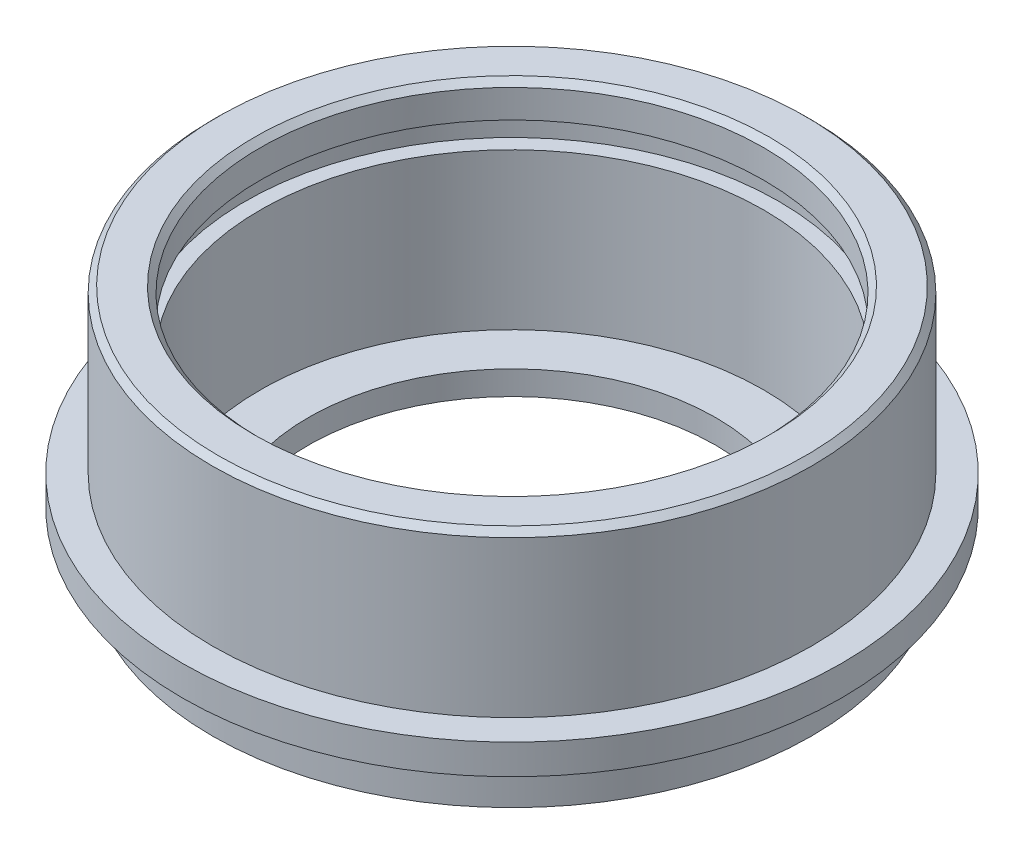
ISO-10303-21;
HEADER;
FILE_DESCRIPTION(('STEP AP214'),'2;1');
FILE_NAME('part.step','',(''),(''),'','','');
FILE_SCHEMA(('AUTOMOTIVE_DESIGN { 1 0 10303 214 1 1 1 1 }'));
ENDSEC;
DATA;
#1=APPLICATION_CONTEXT('core data for automotive mechanical design processes');
#2=APPLICATION_PROTOCOL_DEFINITION('international standard','automotive_design',2000,#1);
#3=PRODUCT_CONTEXT('',#1,'mechanical');
#4=PRODUCT('Part','Part','',(#3));
#5=PRODUCT_RELATED_PRODUCT_CATEGORY('part','',(#4));
#6=PRODUCT_DEFINITION_FORMATION('','',#4);
#7=PRODUCT_DEFINITION_CONTEXT('part definition',#1,'design');
#8=PRODUCT_DEFINITION('design','',#6,#7);
#9=PRODUCT_DEFINITION_SHAPE('','',#8);
#10=(LENGTH_UNIT() NAMED_UNIT(*) SI_UNIT(.MILLI.,.METRE.));
#11=(NAMED_UNIT(*) PLANE_ANGLE_UNIT() SI_UNIT($,.RADIAN.));
#12=(NAMED_UNIT(*) SI_UNIT($,.STERADIAN.) SOLID_ANGLE_UNIT());
#13=UNCERTAINTY_MEASURE_WITH_UNIT(LENGTH_MEASURE(1.E-05),#10,'distance_accuracy_value','');
#14=(GEOMETRIC_REPRESENTATION_CONTEXT(3) GLOBAL_UNCERTAINTY_ASSIGNED_CONTEXT((#13)) GLOBAL_UNIT_ASSIGNED_CONTEXT((#10,
#11,#12)) REPRESENTATION_CONTEXT('',''));
#15=CARTESIAN_POINT('',(0.,0.,0.));
#16=DIRECTION('',(0.,0.,1.));
#17=DIRECTION('',(1.,0.,0.));
#18=AXIS2_PLACEMENT_3D('',#15,#16,#17);
#19=CARTESIAN_POINT('',(25.,0.,0.));
#20=DIRECTION('',(0.,-1.,0.));
#21=DIRECTION('',(0.,0.,-1.));
#22=AXIS2_PLACEMENT_3D('',#19,#20,#21);
#23=PLANE('',#22);
#24=CARTESIAN_POINT('',(0.,0.,0.));
#25=DIRECTION('',(0.,-1.,0.));
#26=DIRECTION('',(0.,0.,-1.));
#27=AXIS2_PLACEMENT_3D('',#24,#25,#26);
#28=CIRCLE('',#27,25.);
#29=CARTESIAN_POINT('',(0.,0.,-25.));
#30=VERTEX_POINT('',#29);
#31=EDGE_CURVE('E89',#30,#30,#28,.T.);
#32=ORIENTED_EDGE('',*,*,#31,.T.);
#33=EDGE_LOOP('',(#32));
#34=FACE_BOUND('',#33,.T.);
#35=CARTESIAN_POINT('',(0.,0.,0.));
#36=DIRECTION('',(0.,-1.,0.));
#37=DIRECTION('',(0.,0.,-1.));
#38=AXIS2_PLACEMENT_3D('',#35,#36,#37);
#39=CIRCLE('',#38,17.);
#40=CARTESIAN_POINT('',(0.,0.,-17.));
#41=VERTEX_POINT('',#40);
#42=EDGE_CURVE('E56',#41,#41,#39,.T.);
#43=ORIENTED_EDGE('',*,*,#42,.F.);
#44=EDGE_LOOP('',(#43));
#45=FACE_BOUND('',#44,.T.);
#46=ADVANCED_FACE('F36',(#34,#45),#23,.T.);
#47=CARTESIAN_POINT('',(0.,0.,0.));
#48=DIRECTION('',(0.,-1.,0.));
#49=DIRECTION('',(0.,0.,-1.));
#50=AXIS2_PLACEMENT_3D('',#47,#48,#49);
#51=CYLINDRICAL_SURFACE('',#50,17.);
#52=ORIENTED_EDGE('',*,*,#42,.T.);
#53=EDGE_LOOP('',(#52));
#54=FACE_BOUND('',#53,.T.);
#55=CARTESIAN_POINT('',(0.,1.99999999999999,0.));
#56=DIRECTION('',(0.,-1.,0.));
#57=DIRECTION('',(0.,0.,-1.));
#58=AXIS2_PLACEMENT_3D('',#55,#56,#57);
#59=CIRCLE('',#58,17.);
#60=CARTESIAN_POINT('',(0.,1.99999999999999,-17.));
#61=VERTEX_POINT('',#60);
#62=EDGE_CURVE('E59',#61,#61,#59,.T.);
#63=ORIENTED_EDGE('',*,*,#62,.F.);
#64=EDGE_LOOP('',(#63));
#65=FACE_BOUND('',#64,.T.);
#66=ADVANCED_FACE('F110',(#54,#65),#51,.F.);
#67=CARTESIAN_POINT('',(17.,1.99999999999999,0.));
#68=DIRECTION('',(0.,1.,0.));
#69=DIRECTION('',(0.,0.,1.));
#70=AXIS2_PLACEMENT_3D('',#67,#68,#69);
#71=PLANE('',#70);
#72=ORIENTED_EDGE('',*,*,#62,.T.);
#73=EDGE_LOOP('',(#72));
#74=FACE_BOUND('',#73,.T.);
#75=CARTESIAN_POINT('',(0.,1.99999999999999,0.));
#76=DIRECTION('',(0.,-1.,0.));
#77=DIRECTION('',(0.,0.,-1.));
#78=AXIS2_PLACEMENT_3D('',#75,#76,#77);
#79=CIRCLE('',#78,21.);
#80=CARTESIAN_POINT('',(0.,1.99999999999999,-21.));
#81=VERTEX_POINT('',#80);
#82=EDGE_CURVE('E62',#81,#81,#79,.T.);
#83=ORIENTED_EDGE('',*,*,#82,.F.);
#84=EDGE_LOOP('',(#83));
#85=FACE_BOUND('',#84,.T.);
#86=ADVANCED_FACE('F115',(#74,#85),#71,.T.);
#87=CARTESIAN_POINT('',(0.,0.,0.));
#88=DIRECTION('',(0.,-1.,0.));
#89=DIRECTION('',(0.,0.,-1.));
#90=AXIS2_PLACEMENT_3D('',#87,#88,#89);
#91=CYLINDRICAL_SURFACE('',#90,21.);
#92=ORIENTED_EDGE('',*,*,#82,.T.);
#93=EDGE_LOOP('',(#92));
#94=FACE_BOUND('',#93,.T.);
#95=CARTESIAN_POINT('',(0.,15.,0.));
#96=DIRECTION('',(0.,-1.,0.));
#97=DIRECTION('',(0.,0.,-1.));
#98=AXIS2_PLACEMENT_3D('',#95,#96,#97);
#99=CIRCLE('',#98,21.);
#100=CARTESIAN_POINT('',(0.,15.,-21.));
#101=VERTEX_POINT('',#100);
#102=EDGE_CURVE('E65',#101,#101,#99,.T.);
#103=ORIENTED_EDGE('',*,*,#102,.F.);
#104=EDGE_LOOP('',(#103));
#105=FACE_BOUND('',#104,.T.);
#106=ADVANCED_FACE('F121',(#94,#105),#91,.F.);
#107=CARTESIAN_POINT('',(21.,15.,0.));
#108=DIRECTION('',(0.,1.,0.));
#109=DIRECTION('',(0.,0.,1.));
#110=AXIS2_PLACEMENT_3D('',#107,#108,#109);
#111=PLANE('',#110);
#112=ORIENTED_EDGE('',*,*,#102,.T.);
#113=EDGE_LOOP('',(#112));
#114=FACE_BOUND('',#113,.T.);
#115=CARTESIAN_POINT('',(0.,15.,0.));
#116=DIRECTION('',(0.,-1.,0.));
#117=DIRECTION('',(0.,0.,-1.));
#118=AXIS2_PLACEMENT_3D('',#115,#116,#117);
#119=CIRCLE('',#118,22.25);
#120=CARTESIAN_POINT('',(0.,15.,-22.25));
#121=VERTEX_POINT('',#120);
#122=EDGE_CURVE('E68',#121,#121,#119,.T.);
#123=ORIENTED_EDGE('',*,*,#122,.F.);
#124=EDGE_LOOP('',(#123));
#125=FACE_BOUND('',#124,.T.);
#126=ADVANCED_FACE('F125',(#114,#125),#111,.T.);
#127=CARTESIAN_POINT('',(0.,0.,0.));
#128=DIRECTION('',(0.,-1.,0.));
#129=DIRECTION('',(0.,0.,-1.));
#130=AXIS2_PLACEMENT_3D('',#127,#128,#129);
#131=CYLINDRICAL_SURFACE('',#130,22.25);
#132=ORIENTED_EDGE('',*,*,#122,.T.);
#133=EDGE_LOOP('',(#132));
#134=FACE_BOUND('',#133,.T.);
#135=CARTESIAN_POINT('',(0.,17.15,0.));
#136=DIRECTION('',(0.,-1.,0.));
#137=DIRECTION('',(0.,0.,-1.));
#138=AXIS2_PLACEMENT_3D('',#135,#136,#137);
#139=CIRCLE('',#138,22.25);
#140=CARTESIAN_POINT('',(0.,17.15,-22.25));
#141=VERTEX_POINT('',#140);
#142=EDGE_CURVE('E71',#141,#141,#139,.T.);
#143=ORIENTED_EDGE('',*,*,#142,.F.);
#144=EDGE_LOOP('',(#143));
#145=FACE_BOUND('',#144,.T.);
#146=ADVANCED_FACE('F129',(#134,#145),#131,.F.);
#147=CARTESIAN_POINT('',(22.25,17.15,0.));
#148=DIRECTION('',(0.,-1.,0.));
#149=DIRECTION('',(0.,0.,-1.));
#150=AXIS2_PLACEMENT_3D('',#147,#148,#149);
#151=PLANE('',#150);
#152=ORIENTED_EDGE('',*,*,#142,.T.);
#153=EDGE_LOOP('',(#152));
#154=FACE_BOUND('',#153,.T.);
#155=CARTESIAN_POINT('',(0.,17.15,0.));
#156=DIRECTION('',(0.,-1.,0.));
#157=DIRECTION('',(0.,0.,-1.));
#158=AXIS2_PLACEMENT_3D('',#155,#156,#157);
#159=CIRCLE('',#158,21.);
#160=CARTESIAN_POINT('',(0.,17.15,-21.));
#161=VERTEX_POINT('',#160);
#162=EDGE_CURVE('E74',#161,#161,#159,.T.);
#163=ORIENTED_EDGE('',*,*,#162,.F.);
#164=EDGE_LOOP('',(#163));
#165=FACE_BOUND('',#164,.T.);
#166=ADVANCED_FACE('F133',(#154,#165),#151,.T.);
#167=CARTESIAN_POINT('',(0.,0.,0.));
#168=DIRECTION('',(0.,-1.,0.));
#169=DIRECTION('',(0.,0.,-1.));
#170=AXIS2_PLACEMENT_3D('',#167,#168,#169);
#171=CYLINDRICAL_SURFACE('',#170,21.);
#172=CARTESIAN_POINT('',(0.,19.5,0.));
#173=DIRECTION('',(0.,1.,0.));
#174=DIRECTION('',(0.,0.,1.));
#175=AXIS2_PLACEMENT_3D('',#172,#173,#174);
#176=CIRCLE('',#175,21.);
#177=CARTESIAN_POINT('',(0.,19.5,21.));
#178=VERTEX_POINT('',#177);
#179=EDGE_CURVE('E10',#178,#178,#176,.T.);
#180=ORIENTED_EDGE('',*,*,#179,.T.);
#181=EDGE_LOOP('',(#180));
#182=FACE_BOUND('',#181,.T.);
#183=ORIENTED_EDGE('',*,*,#162,.T.);
#184=EDGE_LOOP('',(#183));
#185=FACE_BOUND('',#184,.T.);
#186=ADVANCED_FACE('F137',(#182,#185),#171,.F.);
#187=CARTESIAN_POINT('',(21.,20.,0.));
#188=DIRECTION('',(0.,1.,0.));
#189=DIRECTION('',(0.,0.,1.));
#190=AXIS2_PLACEMENT_3D('',#187,#188,#189);
#191=PLANE('',#190);
#192=CARTESIAN_POINT('',(0.,20.,0.));
#193=DIRECTION('',(0.,1.,0.));
#194=DIRECTION('',(0.,0.,1.));
#195=AXIS2_PLACEMENT_3D('',#192,#193,#194);
#196=CIRCLE('',#195,24.5);
#197=CARTESIAN_POINT('',(0.,20.,24.5));
#198=VERTEX_POINT('',#197);
#199=EDGE_CURVE('E43',#198,#198,#196,.T.);
#200=ORIENTED_EDGE('',*,*,#199,.T.);
#201=EDGE_LOOP('',(#200));
#202=FACE_BOUND('',#201,.T.);
#203=CARTESIAN_POINT('',(0.,20.,0.));
#204=DIRECTION('',(0.,1.,0.));
#205=DIRECTION('',(0.,0.,1.));
#206=AXIS2_PLACEMENT_3D('',#203,#204,#205);
#207=CIRCLE('',#206,21.5);
#208=CARTESIAN_POINT('',(0.,20.,21.5));
#209=VERTEX_POINT('',#208);
#210=EDGE_CURVE('E47',#209,#209,#207,.F.);
#211=ORIENTED_EDGE('',*,*,#210,.T.);
#212=EDGE_LOOP('',(#211));
#213=FACE_BOUND('',#212,.T.);
#214=ADVANCED_FACE('F141',(#202,#213),#191,.T.);
#215=CARTESIAN_POINT('',(0.,0.,0.));
#216=DIRECTION('',(0.,-1.,0.));
#217=DIRECTION('',(0.,0.,-1.));
#218=AXIS2_PLACEMENT_3D('',#215,#216,#217);
#219=CYLINDRICAL_SURFACE('',#218,25.);
#220=CARTESIAN_POINT('',(0.,19.5,0.));
#221=DIRECTION('',(0.,1.,0.));
#222=DIRECTION('',(0.,0.,1.));
#223=AXIS2_PLACEMENT_3D('',#220,#221,#222);
#224=CIRCLE('',#223,25.);
#225=CARTESIAN_POINT('',(0.,19.5,25.));
#226=VERTEX_POINT('',#225);
#227=EDGE_CURVE('E51',#226,#226,#224,.F.);
#228=ORIENTED_EDGE('',*,*,#227,.T.);
#229=EDGE_LOOP('',(#228));
#230=FACE_BOUND('',#229,.T.);
#231=CARTESIAN_POINT('',(0.,6.50000000000001,0.));
#232=DIRECTION('',(0.,-1.,0.));
#233=DIRECTION('',(0.,0.,-1.));
#234=AXIS2_PLACEMENT_3D('',#231,#232,#233);
#235=CIRCLE('',#234,25.);
#236=CARTESIAN_POINT('',(0.,6.50000000000001,-25.));
#237=VERTEX_POINT('',#236);
#238=EDGE_CURVE('E77',#237,#237,#235,.T.);
#239=ORIENTED_EDGE('',*,*,#238,.F.);
#240=EDGE_LOOP('',(#239));
#241=FACE_BOUND('',#240,.T.);
#242=ADVANCED_FACE('F144',(#230,#241),#219,.T.);
#243=CARTESIAN_POINT('',(25.,6.50000000000001,0.));
#244=DIRECTION('',(0.,1.,0.));
#245=DIRECTION('',(0.,0.,1.));
#246=AXIS2_PLACEMENT_3D('',#243,#244,#245);
#247=PLANE('',#246);
#248=ORIENTED_EDGE('',*,*,#238,.T.);
#249=EDGE_LOOP('',(#248));
#250=FACE_BOUND('',#249,.T.);
#251=CARTESIAN_POINT('',(0.,6.50000000000001,0.));
#252=DIRECTION('',(0.,-1.,0.));
#253=DIRECTION('',(0.,0.,-1.));
#254=AXIS2_PLACEMENT_3D('',#251,#252,#253);
#255=CIRCLE('',#254,27.5);
#256=CARTESIAN_POINT('',(0.,6.50000000000001,-27.5));
#257=VERTEX_POINT('',#256);
#258=EDGE_CURVE('E80',#257,#257,#255,.T.);
#259=ORIENTED_EDGE('',*,*,#258,.F.);
#260=EDGE_LOOP('',(#259));
#261=FACE_BOUND('',#260,.T.);
#262=ADVANCED_FACE('F147',(#250,#261),#247,.T.);
#263=CARTESIAN_POINT('',(0.,0.,0.));
#264=DIRECTION('',(0.,-1.,0.));
#265=DIRECTION('',(0.,0.,-1.));
#266=AXIS2_PLACEMENT_3D('',#263,#264,#265);
#267=CYLINDRICAL_SURFACE('',#266,27.5);
#268=ORIENTED_EDGE('',*,*,#258,.T.);
#269=EDGE_LOOP('',(#268));
#270=FACE_BOUND('',#269,.T.);
#271=CARTESIAN_POINT('',(0.,4.00000000000001,0.));
#272=DIRECTION('',(0.,-1.,0.));
#273=DIRECTION('',(0.,0.,-1.));
#274=AXIS2_PLACEMENT_3D('',#271,#272,#273);
#275=CIRCLE('',#274,27.5);
#276=CARTESIAN_POINT('',(0.,4.00000000000001,-27.5));
#277=VERTEX_POINT('',#276);
#278=EDGE_CURVE('E83',#277,#277,#275,.T.);
#279=ORIENTED_EDGE('',*,*,#278,.F.);
#280=EDGE_LOOP('',(#279));
#281=FACE_BOUND('',#280,.T.);
#282=ADVANCED_FACE('F106',(#270,#281),#267,.T.);
#283=CARTESIAN_POINT('',(27.5,4.00000000000001,0.));
#284=DIRECTION('',(0.,-1.,0.));
#285=DIRECTION('',(0.,0.,-1.));
#286=AXIS2_PLACEMENT_3D('',#283,#284,#285);
#287=PLANE('',#286);
#288=ORIENTED_EDGE('',*,*,#278,.T.);
#289=EDGE_LOOP('',(#288));
#290=FACE_BOUND('',#289,.T.);
#291=CARTESIAN_POINT('',(0.,4.00000000000001,0.));
#292=DIRECTION('',(0.,-1.,0.));
#293=DIRECTION('',(0.,0.,-1.));
#294=AXIS2_PLACEMENT_3D('',#291,#292,#293);
#295=CIRCLE('',#294,25.);
#296=CARTESIAN_POINT('',(0.,4.00000000000001,-25.));
#297=VERTEX_POINT('',#296);
#298=EDGE_CURVE('E86',#297,#297,#295,.T.);
#299=ORIENTED_EDGE('',*,*,#298,.F.);
#300=EDGE_LOOP('',(#299));
#301=FACE_BOUND('',#300,.T.);
#302=ADVANCED_FACE('F98',(#290,#301),#287,.T.);
#303=CARTESIAN_POINT('',(0.,0.,0.));
#304=DIRECTION('',(0.,-1.,0.));
#305=DIRECTION('',(0.,0.,-1.));
#306=AXIS2_PLACEMENT_3D('',#303,#304,#305);
#307=CYLINDRICAL_SURFACE('',#306,25.);
#308=ORIENTED_EDGE('',*,*,#298,.T.);
#309=EDGE_LOOP('',(#308));
#310=FACE_BOUND('',#309,.T.);
#311=ORIENTED_EDGE('',*,*,#31,.F.);
#312=EDGE_LOOP('',(#311));
#313=FACE_BOUND('',#312,.T.);
#314=ADVANCED_FACE('F95',(#310,#313),#307,.T.);
#315=CARTESIAN_POINT('',(0.,19.5,0.));
#316=DIRECTION('',(0.,-1.,0.));
#317=DIRECTION('',(0.,0.,-1.));
#318=AXIS2_PLACEMENT_3D('',#315,#316,#317);
#319=CONICAL_SURFACE('',#318,25.,0.785398163397448);
#320=ORIENTED_EDGE('',*,*,#199,.F.);
#321=EDGE_LOOP('',(#320));
#322=FACE_BOUND('',#321,.T.);
#323=ORIENTED_EDGE('',*,*,#227,.F.);
#324=EDGE_LOOP('',(#323));
#325=FACE_BOUND('',#324,.T.);
#326=ADVANCED_FACE('F97',(#322,#325),#319,.T.);
#327=CARTESIAN_POINT('',(0.,20.,0.));
#328=DIRECTION('',(0.,1.,0.));
#329=DIRECTION('',(0.,0.,1.));
#330=AXIS2_PLACEMENT_3D('',#327,#328,#329);
#331=CONICAL_SURFACE('',#330,21.5,0.785398163397445);
#332=ORIENTED_EDGE('',*,*,#179,.F.);
#333=EDGE_LOOP('',(#332));
#334=FACE_BOUND('',#333,.T.);
#335=ORIENTED_EDGE('',*,*,#210,.F.);
#336=EDGE_LOOP('',(#335));
#337=FACE_BOUND('',#336,.T.);
#338=ADVANCED_FACE('F38',(#334,#337),#331,.F.);
#339=CLOSED_SHELL('',(#46,#66,#86,#106,#126,#146,#166,#186,#214,#242,#262,#282,#302,#314,#326,#338));
#340=MANIFOLD_SOLID_BREP('B2',#339);
#341=ADVANCED_BREP_SHAPE_REPRESENTATION('',(#18,#340),#14);
#342=SHAPE_DEFINITION_REPRESENTATION(#9,#341);
ENDSEC;
END-ISO-10303-21;
